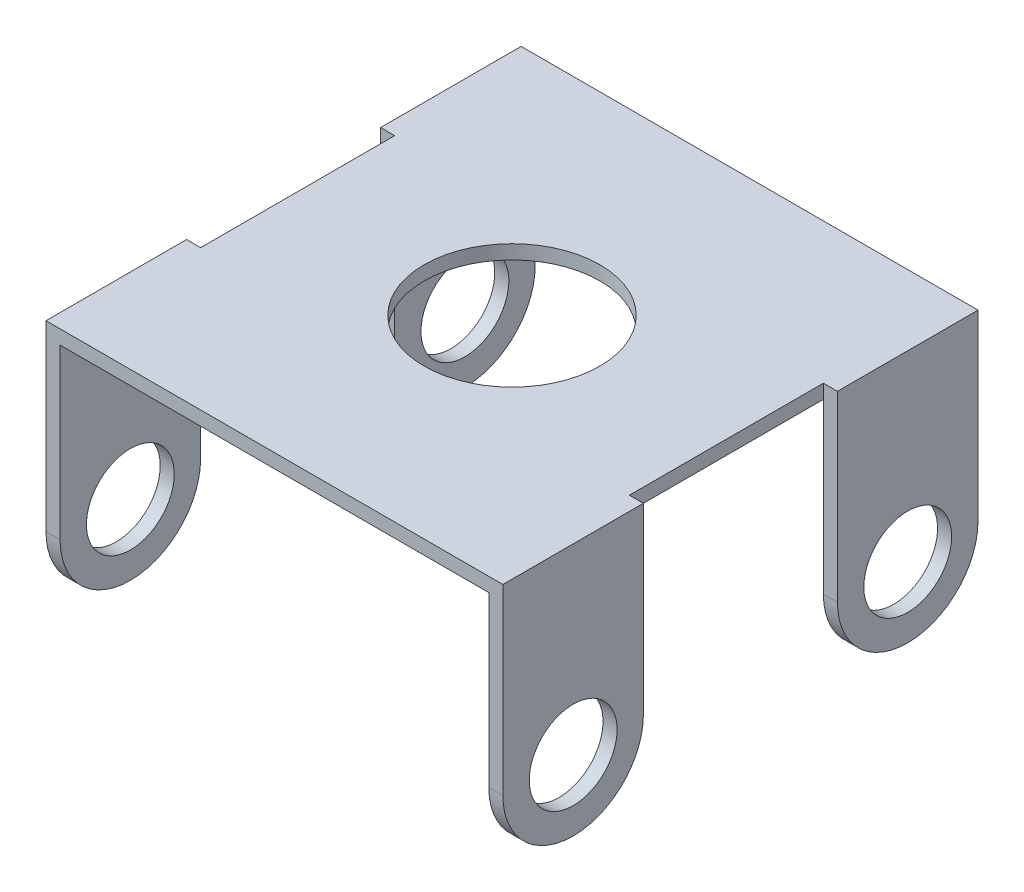
ISO-10303-21;
HEADER;
FILE_DESCRIPTION(('STEP AP214'),'2;1');
FILE_NAME('part.step','',(''),(''),'','','');
FILE_SCHEMA(('AUTOMOTIVE_DESIGN { 1 0 10303 214 1 1 1 1 }'));
ENDSEC;
DATA;
#1=APPLICATION_CONTEXT('core data for automotive mechanical design processes');
#2=APPLICATION_PROTOCOL_DEFINITION('international standard','automotive_design',2000,#1);
#3=PRODUCT_CONTEXT('',#1,'mechanical');
#4=PRODUCT('Part','Part','',(#3));
#5=PRODUCT_RELATED_PRODUCT_CATEGORY('part','',(#4));
#6=PRODUCT_DEFINITION_FORMATION('','',#4);
#7=PRODUCT_DEFINITION_CONTEXT('part definition',#1,'design');
#8=PRODUCT_DEFINITION('design','',#6,#7);
#9=PRODUCT_DEFINITION_SHAPE('','',#8);
#10=(LENGTH_UNIT() NAMED_UNIT(*) SI_UNIT(.MILLI.,.METRE.));
#11=(NAMED_UNIT(*) PLANE_ANGLE_UNIT() SI_UNIT($,.RADIAN.));
#12=(NAMED_UNIT(*) SI_UNIT($,.STERADIAN.) SOLID_ANGLE_UNIT());
#13=UNCERTAINTY_MEASURE_WITH_UNIT(LENGTH_MEASURE(1.E-05),#10,'distance_accuracy_value','');
#14=(GEOMETRIC_REPRESENTATION_CONTEXT(3) GLOBAL_UNCERTAINTY_ASSIGNED_CONTEXT((#13)) GLOBAL_UNIT_ASSIGNED_CONTEXT((#10,
#11,#12)) REPRESENTATION_CONTEXT('',''));
#15=CARTESIAN_POINT('',(0.,0.,0.));
#16=DIRECTION('',(0.,0.,1.));
#17=DIRECTION('',(1.,0.,0.));
#18=AXIS2_PLACEMENT_3D('',#15,#16,#17);
#19=CARTESIAN_POINT('',(-19.3675,1.27,-21.463));
#20=DIRECTION('',(1.,0.,0.));
#21=DIRECTION('',(0.,0.,-1.));
#22=AXIS2_PLACEMENT_3D('',#19,#20,#21);
#23=PLANE('',#22);
#24=DIRECTION('',(0.,0.,1.));
#25=VECTOR('',#24,1.);
#26=CARTESIAN_POINT('',(-19.3675,1.27,-21.463));
#27=LINE('',#26,#25);
#28=CARTESIAN_POINT('',(-19.3675,1.27,-8.76299999999999));
#29=VERTEX_POINT('',#28);
#30=CARTESIAN_POINT('',(-19.3675,1.27,8.76299999999999));
#31=VERTEX_POINT('',#30);
#32=EDGE_CURVE('E51',#29,#31,#27,.T.);
#33=ORIENTED_EDGE('',*,*,#32,.F.);
#34=DIRECTION('',(0.,-1.,0.));
#35=VECTOR('',#34,1.);
#36=CARTESIAN_POINT('',(-19.3675,0.,-8.76299999999999));
#37=LINE('',#36,#35);
#38=CARTESIAN_POINT('',(-19.3675,0.,-8.76299999999999));
#39=VERTEX_POINT('',#38);
#40=EDGE_CURVE('E529',#29,#39,#37,.T.);
#41=ORIENTED_EDGE('',*,*,#40,.T.);
#42=DIRECTION('',(0.,0.,1.));
#43=VECTOR('',#42,1.);
#44=CARTESIAN_POINT('',(-19.3675,0.,-21.463));
#45=LINE('',#44,#43);
#46=CARTESIAN_POINT('',(-19.3675,0.,8.76299999999999));
#47=VERTEX_POINT('',#46);
#48=EDGE_CURVE('E363',#39,#47,#45,.T.);
#49=ORIENTED_EDGE('',*,*,#48,.T.);
#50=DIRECTION('',(0.,-1.,0.));
#51=VECTOR('',#50,1.);
#52=CARTESIAN_POINT('',(-19.3675,0.,8.76299999999999));
#53=LINE('',#52,#51);
#54=EDGE_CURVE('E229',#31,#47,#53,.T.);
#55=ORIENTED_EDGE('',*,*,#54,.F.);
#56=EDGE_LOOP('',(#33,#41,#49,#55));
#57=FACE_BOUND('',#56,.T.);
#58=ADVANCED_FACE('F41',(#57),#23,.F.);
#59=CARTESIAN_POINT('',(19.3675,1.27,-21.463));
#60=DIRECTION('',(-1.,0.,0.));
#61=DIRECTION('',(0.,0.,1.));
#62=AXIS2_PLACEMENT_3D('',#59,#60,#61);
#63=PLANE('',#62);
#64=DIRECTION('',(0.,-1.,0.));
#65=VECTOR('',#64,1.);
#66=CARTESIAN_POINT('',(19.3675,0.,-8.76299999999999));
#67=LINE('',#66,#65);
#68=CARTESIAN_POINT('',(19.3675,1.27,-8.76299999999999));
#69=VERTEX_POINT('',#68);
#70=CARTESIAN_POINT('',(19.3675,0.,-8.76299999999999));
#71=VERTEX_POINT('',#70);
#72=EDGE_CURVE('E276',#69,#71,#67,.T.);
#73=ORIENTED_EDGE('',*,*,#72,.F.);
#74=DIRECTION('',(0.,0.,-1.));
#75=VECTOR('',#74,1.);
#76=CARTESIAN_POINT('',(19.3675,1.27,-21.463));
#77=LINE('',#76,#75);
#78=CARTESIAN_POINT('',(19.3675,1.27,8.76299999999999));
#79=VERTEX_POINT('',#78);
#80=EDGE_CURVE('E341',#79,#69,#77,.T.);
#81=ORIENTED_EDGE('',*,*,#80,.F.);
#82=DIRECTION('',(0.,-1.,0.));
#83=VECTOR('',#82,1.);
#84=CARTESIAN_POINT('',(19.3675,0.,8.76299999999999));
#85=LINE('',#84,#83);
#86=CARTESIAN_POINT('',(19.3675,0.,8.76299999999999));
#87=VERTEX_POINT('',#86);
#88=EDGE_CURVE('E300',#79,#87,#85,.T.);
#89=ORIENTED_EDGE('',*,*,#88,.T.);
#90=DIRECTION('',(0.,0.,-1.));
#91=VECTOR('',#90,1.);
#92=CARTESIAN_POINT('',(19.3675,0.,-21.463));
#93=LINE('',#92,#91);
#94=EDGE_CURVE('E356',#87,#71,#93,.T.);
#95=ORIENTED_EDGE('',*,*,#94,.T.);
#96=EDGE_LOOP('',(#73,#81,#89,#95));
#97=FACE_BOUND('',#96,.T.);
#98=ADVANCED_FACE('F43',(#97),#63,.F.);
#99=CARTESIAN_POINT('',(-19.3675,1.27,-21.463));
#100=DIRECTION('',(0.,0.,1.));
#101=DIRECTION('',(1.,0.,0.));
#102=AXIS2_PLACEMENT_3D('',#99,#100,#101);
#103=PLANE('',#102);
#104=DIRECTION('',(-1.,0.,0.));
#105=VECTOR('',#104,1.);
#106=CARTESIAN_POINT('',(-19.3675,0.,-21.463));
#107=LINE('',#106,#105);
#108=CARTESIAN_POINT('',(19.3675,0.,-21.463));
#109=VERTEX_POINT('',#108);
#110=CARTESIAN_POINT('',(-19.3675,0.,-21.463));
#111=VERTEX_POINT('',#110);
#112=EDGE_CURVE('E355',#109,#111,#107,.T.);
#113=ORIENTED_EDGE('',*,*,#112,.T.);
#114=DIRECTION('',(0.,-1.,0.));
#115=VECTOR('',#114,1.);
#116=CARTESIAN_POINT('',(-19.3675,0.,-21.463));
#117=LINE('',#116,#115);
#118=CARTESIAN_POINT('',(-19.3675,-15.24,-21.463));
#119=VERTEX_POINT('',#118);
#120=EDGE_CURVE('E191',#111,#119,#117,.T.);
#121=ORIENTED_EDGE('',*,*,#120,.T.);
#122=DIRECTION('',(1.,0.,0.));
#123=VECTOR('',#122,1.);
#124=CARTESIAN_POINT('',(-20.6375,-15.24,-21.463));
#125=LINE('',#124,#123);
#126=CARTESIAN_POINT('',(-20.6375,-15.24,-21.463));
#127=VERTEX_POINT('',#126);
#128=EDGE_CURVE('E170',#127,#119,#125,.T.);
#129=ORIENTED_EDGE('',*,*,#128,.F.);
#130=DIRECTION('',(0.,-1.,0.));
#131=VECTOR('',#130,1.);
#132=CARTESIAN_POINT('',(-20.6375,0.,-21.463));
#133=LINE('',#132,#131);
#134=CARTESIAN_POINT('',(-20.6375,1.27,-21.463));
#135=VERTEX_POINT('',#134);
#136=EDGE_CURVE('E178',#135,#127,#133,.T.);
#137=ORIENTED_EDGE('',*,*,#136,.F.);
#138=DIRECTION('',(-1.,0.,0.));
#139=VECTOR('',#138,1.);
#140=CARTESIAN_POINT('',(-19.3675,1.27,-21.463));
#141=LINE('',#140,#139);
#142=CARTESIAN_POINT('',(20.6375,1.27,-21.463));
#143=VERTEX_POINT('',#142);
#144=EDGE_CURVE('E345',#143,#135,#141,.T.);
#145=ORIENTED_EDGE('',*,*,#144,.F.);
#146=DIRECTION('',(0.,-1.,0.));
#147=VECTOR('',#146,1.);
#148=CARTESIAN_POINT('',(20.6375,0.,-21.463));
#149=LINE('',#148,#147);
#150=CARTESIAN_POINT('',(20.6375,-15.24,-21.463));
#151=VERTEX_POINT('',#150);
#152=EDGE_CURVE('E252',#143,#151,#149,.T.);
#153=ORIENTED_EDGE('',*,*,#152,.T.);
#154=DIRECTION('',(-1.,0.,0.));
#155=VECTOR('',#154,1.);
#156=CARTESIAN_POINT('',(20.6375,-15.24,-21.463));
#157=LINE('',#156,#155);
#158=CARTESIAN_POINT('',(19.3675,-15.24,-21.463));
#159=VERTEX_POINT('',#158);
#160=EDGE_CURVE('E268',#151,#159,#157,.T.);
#161=ORIENTED_EDGE('',*,*,#160,.T.);
#162=DIRECTION('',(0.,-1.,0.));
#163=VECTOR('',#162,1.);
#164=CARTESIAN_POINT('',(19.3675,0.,-21.463));
#165=LINE('',#164,#163);
#166=EDGE_CURVE('E272',#109,#159,#165,.T.);
#167=ORIENTED_EDGE('',*,*,#166,.F.);
#168=EDGE_LOOP('',(#113,#121,#129,#137,#145,#153,#161,#167));
#169=FACE_BOUND('',#168,.T.);
#170=ADVANCED_FACE('F189',(#169),#103,.F.);
#171=CARTESIAN_POINT('',(-19.3675,1.27,21.463));
#172=DIRECTION('',(0.,0.,-1.));
#173=DIRECTION('',(-1.,0.,0.));
#174=AXIS2_PLACEMENT_3D('',#171,#172,#173);
#175=PLANE('',#174);
#176=DIRECTION('',(1.,0.,0.));
#177=VECTOR('',#176,1.);
#178=CARTESIAN_POINT('',(-19.3675,0.,21.463));
#179=LINE('',#178,#177);
#180=CARTESIAN_POINT('',(-19.3675,0.,21.463));
#181=VERTEX_POINT('',#180);
#182=CARTESIAN_POINT('',(19.3675,0.,21.463));
#183=VERTEX_POINT('',#182);
#184=EDGE_CURVE('E346',#181,#183,#179,.T.);
#185=ORIENTED_EDGE('',*,*,#184,.T.);
#186=DIRECTION('',(0.,-1.,0.));
#187=VECTOR('',#186,1.);
#188=CARTESIAN_POINT('',(19.3675,0.,21.463));
#189=LINE('',#188,#187);
#190=CARTESIAN_POINT('',(19.3675,-15.24,21.463));
#191=VERTEX_POINT('',#190);
#192=EDGE_CURVE('E319',#183,#191,#189,.T.);
#193=ORIENTED_EDGE('',*,*,#192,.T.);
#194=DIRECTION('',(-1.,0.,0.));
#195=VECTOR('',#194,1.);
#196=CARTESIAN_POINT('',(20.6375,-15.24,21.463));
#197=LINE('',#196,#195);
#198=CARTESIAN_POINT('',(20.6375,-15.24,21.463));
#199=VERTEX_POINT('',#198);
#200=EDGE_CURVE('E336',#199,#191,#197,.T.);
#201=ORIENTED_EDGE('',*,*,#200,.F.);
#202=DIRECTION('',(0.,-1.,0.));
#203=VECTOR('',#202,1.);
#204=CARTESIAN_POINT('',(20.6375,0.,21.463));
#205=LINE('',#204,#203);
#206=CARTESIAN_POINT('',(20.6375,1.27,21.463));
#207=VERTEX_POINT('',#206);
#208=EDGE_CURVE('E299',#207,#199,#205,.T.);
#209=ORIENTED_EDGE('',*,*,#208,.F.);
#210=DIRECTION('',(1.,0.,0.));
#211=VECTOR('',#210,1.);
#212=CARTESIAN_POINT('',(-19.3675,1.27,21.463));
#213=LINE('',#212,#211);
#214=CARTESIAN_POINT('',(-20.6375,1.27,21.463));
#215=VERTEX_POINT('',#214);
#216=EDGE_CURVE('E11',#215,#207,#213,.T.);
#217=ORIENTED_EDGE('',*,*,#216,.F.);
#218=DIRECTION('',(0.,-1.,0.));
#219=VECTOR('',#218,1.);
#220=CARTESIAN_POINT('',(-20.6375,0.,21.463));
#221=LINE('',#220,#219);
#222=CARTESIAN_POINT('',(-20.6375,-15.24,21.463));
#223=VERTEX_POINT('',#222);
#224=EDGE_CURVE('E209',#215,#223,#221,.T.);
#225=ORIENTED_EDGE('',*,*,#224,.T.);
#226=DIRECTION('',(1.,0.,0.));
#227=VECTOR('',#226,1.);
#228=CARTESIAN_POINT('',(-20.6375,-15.24,21.463));
#229=LINE('',#228,#227);
#230=CARTESIAN_POINT('',(-19.3675,-15.24,21.463));
#231=VERTEX_POINT('',#230);
#232=EDGE_CURVE('E224',#223,#231,#229,.T.);
#233=ORIENTED_EDGE('',*,*,#232,.T.);
#234=DIRECTION('',(0.,-1.,0.));
#235=VECTOR('',#234,1.);
#236=CARTESIAN_POINT('',(-19.3675,0.,21.463));
#237=LINE('',#236,#235);
#238=EDGE_CURVE('E199',#181,#231,#237,.T.);
#239=ORIENTED_EDGE('',*,*,#238,.F.);
#240=EDGE_LOOP('',(#185,#193,#201,#209,#217,#225,#233,#239));
#241=FACE_BOUND('',#240,.T.);
#242=ADVANCED_FACE('F369',(#241),#175,.F.);
#243=CARTESIAN_POINT('',(0.,1.27,0.));
#244=DIRECTION('',(0.,1.,0.));
#245=DIRECTION('',(0.,0.,1.));
#246=AXIS2_PLACEMENT_3D('',#243,#244,#245);
#247=PLANE('',#246);
#248=CARTESIAN_POINT('',(0.,1.27,0.));
#249=DIRECTION('',(0.,1.,0.));
#250=DIRECTION('',(0.,0.,1.));
#251=AXIS2_PLACEMENT_3D('',#248,#249,#250);
#252=CIRCLE('',#251,7.9375);
#253=CARTESIAN_POINT('',(0.,1.27,7.9375));
#254=VERTEX_POINT('',#253);
#255=EDGE_CURVE('E516',#254,#254,#252,.T.);
#256=ORIENTED_EDGE('',*,*,#255,.F.);
#257=EDGE_LOOP('',(#256));
#258=FACE_BOUND('',#257,.T.);
#259=ORIENTED_EDGE('',*,*,#216,.T.);
#260=DIRECTION('',(0.,0.,1.));
#261=VECTOR('',#260,1.);
#262=CARTESIAN_POINT('',(20.6375,1.27,0.));
#263=LINE('',#262,#261);
#264=CARTESIAN_POINT('',(20.6375,1.27,8.76299999999999));
#265=VERTEX_POINT('',#264);
#266=EDGE_CURVE('E311',#265,#207,#263,.T.);
#267=ORIENTED_EDGE('',*,*,#266,.F.);
#268=DIRECTION('',(-1.,0.,0.));
#269=VECTOR('',#268,1.);
#270=CARTESIAN_POINT('',(20.6375,1.27,8.76299999999999));
#271=LINE('',#270,#269);
#272=EDGE_CURVE('E315',#265,#79,#271,.T.);
#273=ORIENTED_EDGE('',*,*,#272,.T.);
#274=ORIENTED_EDGE('',*,*,#80,.T.);
#275=DIRECTION('',(-1.,0.,0.));
#276=VECTOR('',#275,1.);
#277=CARTESIAN_POINT('',(20.6375,1.27,-8.76299999999999));
#278=LINE('',#277,#276);
#279=CARTESIAN_POINT('',(20.6375,1.27,-8.76299999999999));
#280=VERTEX_POINT('',#279);
#281=EDGE_CURVE('E290',#280,#69,#278,.T.);
#282=ORIENTED_EDGE('',*,*,#281,.F.);
#283=DIRECTION('',(0.,0.,-1.));
#284=VECTOR('',#283,1.);
#285=CARTESIAN_POINT('',(20.6375,1.27,0.));
#286=LINE('',#285,#284);
#287=EDGE_CURVE('E257',#280,#143,#286,.T.);
#288=ORIENTED_EDGE('',*,*,#287,.T.);
#289=ORIENTED_EDGE('',*,*,#144,.T.);
#290=DIRECTION('',(0.,0.,-1.));
#291=VECTOR('',#290,1.);
#292=CARTESIAN_POINT('',(-20.6375,1.27,0.));
#293=LINE('',#292,#291);
#294=CARTESIAN_POINT('',(-20.6375,1.27,-8.76299999999999));
#295=VERTEX_POINT('',#294);
#296=EDGE_CURVE('E184',#295,#135,#293,.T.);
#297=ORIENTED_EDGE('',*,*,#296,.F.);
#298=DIRECTION('',(1.,0.,0.));
#299=VECTOR('',#298,1.);
#300=CARTESIAN_POINT('',(-20.6375,1.27,-8.76299999999999));
#301=LINE('',#300,#299);
#302=EDGE_CURVE('E201',#295,#29,#301,.T.);
#303=ORIENTED_EDGE('',*,*,#302,.T.);
#304=ORIENTED_EDGE('',*,*,#32,.T.);
#305=DIRECTION('',(1.,0.,0.));
#306=VECTOR('',#305,1.);
#307=CARTESIAN_POINT('',(-20.6375,1.27,8.76299999999999));
#308=LINE('',#307,#306);
#309=CARTESIAN_POINT('',(-20.6375,1.27,8.76299999999999));
#310=VERTEX_POINT('',#309);
#311=EDGE_CURVE('E243',#310,#31,#308,.T.);
#312=ORIENTED_EDGE('',*,*,#311,.F.);
#313=DIRECTION('',(0.,0.,1.));
#314=VECTOR('',#313,1.);
#315=CARTESIAN_POINT('',(-20.6375,1.27,0.));
#316=LINE('',#315,#314);
#317=EDGE_CURVE('E214',#310,#215,#316,.T.);
#318=ORIENTED_EDGE('',*,*,#317,.T.);
#319=EDGE_LOOP('',(#259,#267,#273,#274,#282,#288,#289,#297,#303,#304,#312,#318));
#320=FACE_BOUND('',#319,.T.);
#321=ADVANCED_FACE('F407',(#258,#320),#247,.T.);
#322=CARTESIAN_POINT('',(0.,0.,0.));
#323=DIRECTION('',(0.,1.,0.));
#324=DIRECTION('',(0.,0.,1.));
#325=AXIS2_PLACEMENT_3D('',#322,#323,#324);
#326=PLANE('',#325);
#327=CARTESIAN_POINT('',(0.,0.,0.));
#328=DIRECTION('',(0.,1.,0.));
#329=DIRECTION('',(0.,0.,1.));
#330=AXIS2_PLACEMENT_3D('',#327,#328,#329);
#331=CIRCLE('',#330,7.9375);
#332=CARTESIAN_POINT('',(0.,0.,7.9375));
#333=VERTEX_POINT('',#332);
#334=EDGE_CURVE('E45',#333,#333,#331,.T.);
#335=ORIENTED_EDGE('',*,*,#334,.T.);
#336=EDGE_LOOP('',(#335));
#337=FACE_BOUND('',#336,.T.);
#338=EDGE_CURVE('E351',#183,#87,#93,.T.);
#339=ORIENTED_EDGE('',*,*,#338,.F.);
#340=ORIENTED_EDGE('',*,*,#184,.F.);
#341=EDGE_CURVE('E359',#47,#181,#45,.T.);
#342=ORIENTED_EDGE('',*,*,#341,.F.);
#343=ORIENTED_EDGE('',*,*,#48,.F.);
#344=EDGE_CURVE('E360',#111,#39,#45,.T.);
#345=ORIENTED_EDGE('',*,*,#344,.F.);
#346=ORIENTED_EDGE('',*,*,#112,.F.);
#347=EDGE_CURVE('E340',#71,#109,#93,.T.);
#348=ORIENTED_EDGE('',*,*,#347,.F.);
#349=ORIENTED_EDGE('',*,*,#94,.F.);
#350=EDGE_LOOP('',(#339,#340,#342,#343,#345,#346,#348,#349));
#351=FACE_BOUND('',#350,.T.);
#352=ADVANCED_FACE('F376',(#337,#351),#326,.F.);
#353=CARTESIAN_POINT('',(19.3675,0.,0.));
#354=DIRECTION('',(1.,0.,0.));
#355=DIRECTION('',(0.,0.,-1.));
#356=AXIS2_PLACEMENT_3D('',#353,#354,#355);
#357=PLANE('',#356);
#358=CARTESIAN_POINT('',(19.3675,-15.24,15.113));
#359=DIRECTION('',(1.,0.,0.));
#360=DIRECTION('',(0.,0.,-1.));
#361=AXIS2_PLACEMENT_3D('',#358,#359,#360);
#362=CIRCLE('',#361,3.96875);
#363=CARTESIAN_POINT('',(19.3675,-15.24,11.14425));
#364=VERTEX_POINT('',#363);
#365=EDGE_CURVE('E294',#364,#364,#362,.T.);
#366=ORIENTED_EDGE('',*,*,#365,.T.);
#367=EDGE_LOOP('',(#366));
#368=FACE_BOUND('',#367,.T.);
#369=ORIENTED_EDGE('',*,*,#192,.F.);
#370=ORIENTED_EDGE('',*,*,#338,.T.);
#371=CARTESIAN_POINT('',(19.3675,-15.24,8.76299999999999));
#372=VERTEX_POINT('',#371);
#373=EDGE_CURVE('E326',#87,#372,#85,.T.);
#374=ORIENTED_EDGE('',*,*,#373,.T.);
#375=CARTESIAN_POINT('',(19.3675,-15.24,15.113));
#376=DIRECTION('',(1.,0.,0.));
#377=DIRECTION('',(0.,0.,-1.));
#378=AXIS2_PLACEMENT_3D('',#375,#376,#377);
#379=CIRCLE('',#378,6.35000000000001);
#380=EDGE_CURVE('E322',#191,#372,#379,.T.);
#381=ORIENTED_EDGE('',*,*,#380,.F.);
#382=EDGE_LOOP('',(#369,#370,#374,#381));
#383=FACE_BOUND('',#382,.T.);
#384=ADVANCED_FACE('F379',(#368,#383),#357,.F.);
#385=CARTESIAN_POINT('',(20.6375,-15.24,15.113));
#386=DIRECTION('',(-1.,0.,0.));
#387=DIRECTION('',(0.,0.,1.));
#388=AXIS2_PLACEMENT_3D('',#385,#386,#387);
#389=CYLINDRICAL_SURFACE('',#388,6.35000000000001);
#390=ORIENTED_EDGE('',*,*,#380,.T.);
#391=DIRECTION('',(-1.,0.,0.));
#392=VECTOR('',#391,1.);
#393=CARTESIAN_POINT('',(20.6375,-15.24,8.76299999999999));
#394=LINE('',#393,#392);
#395=CARTESIAN_POINT('',(20.6375,-15.24,8.76299999999999));
#396=VERTEX_POINT('',#395);
#397=EDGE_CURVE('E332',#396,#372,#394,.T.);
#398=ORIENTED_EDGE('',*,*,#397,.F.);
#399=CARTESIAN_POINT('',(20.6375,-15.24,15.113));
#400=DIRECTION('',(1.,0.,0.));
#401=DIRECTION('',(0.,0.,-1.));
#402=AXIS2_PLACEMENT_3D('',#399,#400,#401);
#403=CIRCLE('',#402,6.35000000000001);
#404=EDGE_CURVE('E304',#199,#396,#403,.T.);
#405=ORIENTED_EDGE('',*,*,#404,.F.);
#406=ORIENTED_EDGE('',*,*,#200,.T.);
#407=EDGE_LOOP('',(#390,#398,#405,#406));
#408=FACE_BOUND('',#407,.T.);
#409=ADVANCED_FACE('F412',(#408),#389,.T.);
#410=CARTESIAN_POINT('',(20.6375,0.,8.76299999999999));
#411=DIRECTION('',(0.,0.,-1.));
#412=DIRECTION('',(0.,1.,0.));
#413=AXIS2_PLACEMENT_3D('',#410,#411,#412);
#414=PLANE('',#413);
#415=ORIENTED_EDGE('',*,*,#88,.F.);
#416=ORIENTED_EDGE('',*,*,#272,.F.);
#417=DIRECTION('',(0.,-1.,0.));
#418=VECTOR('',#417,1.);
#419=CARTESIAN_POINT('',(20.6375,0.,8.76299999999999));
#420=LINE('',#419,#418);
#421=EDGE_CURVE('E307',#265,#396,#420,.T.);
#422=ORIENTED_EDGE('',*,*,#421,.T.);
#423=ORIENTED_EDGE('',*,*,#397,.T.);
#424=ORIENTED_EDGE('',*,*,#373,.F.);
#425=EDGE_LOOP('',(#415,#416,#422,#423,#424));
#426=FACE_BOUND('',#425,.T.);
#427=ADVANCED_FACE('F385',(#426),#414,.T.);
#428=CARTESIAN_POINT('',(20.6375,-15.24,15.113));
#429=DIRECTION('',(-1.,0.,0.));
#430=DIRECTION('',(0.,0.,1.));
#431=AXIS2_PLACEMENT_3D('',#428,#429,#430);
#432=CYLINDRICAL_SURFACE('',#431,3.96875);
#433=CARTESIAN_POINT('',(20.6375,-15.24,15.113));
#434=DIRECTION('',(1.,0.,0.));
#435=DIRECTION('',(0.,0.,-1.));
#436=AXIS2_PLACEMENT_3D('',#433,#434,#435);
#437=CIRCLE('',#436,3.96875);
#438=CARTESIAN_POINT('',(20.6375,-15.24,11.14425));
#439=VERTEX_POINT('',#438);
#440=EDGE_CURVE('E295',#439,#439,#437,.T.);
#441=ORIENTED_EDGE('',*,*,#440,.T.);
#442=EDGE_LOOP('',(#441));
#443=FACE_BOUND('',#442,.T.);
#444=ORIENTED_EDGE('',*,*,#365,.F.);
#445=EDGE_LOOP('',(#444));
#446=FACE_BOUND('',#445,.T.);
#447=ADVANCED_FACE('F419',(#443,#446),#432,.F.);
#448=CARTESIAN_POINT('',(20.6375,0.,0.));
#449=DIRECTION('',(1.,0.,0.));
#450=DIRECTION('',(0.,0.,-1.));
#451=AXIS2_PLACEMENT_3D('',#448,#449,#450);
#452=PLANE('',#451);
#453=ORIENTED_EDGE('',*,*,#440,.F.);
#454=EDGE_LOOP('',(#453));
#455=FACE_BOUND('',#454,.T.);
#456=ORIENTED_EDGE('',*,*,#208,.T.);
#457=ORIENTED_EDGE('',*,*,#404,.T.);
#458=ORIENTED_EDGE('',*,*,#421,.F.);
#459=ORIENTED_EDGE('',*,*,#266,.T.);
#460=EDGE_LOOP('',(#456,#457,#458,#459));
#461=FACE_BOUND('',#460,.T.);
#462=ADVANCED_FACE('F410',(#455,#461),#452,.T.);
#463=CARTESIAN_POINT('',(19.3675,0.,0.));
#464=DIRECTION('',(1.,0.,0.));
#465=DIRECTION('',(0.,0.,1.));
#466=AXIS2_PLACEMENT_3D('',#463,#464,#465);
#467=PLANE('',#466);
#468=CARTESIAN_POINT('',(19.3675,-15.24,-15.113));
#469=DIRECTION('',(-1.,0.,0.));
#470=DIRECTION('',(0.,0.,1.));
#471=AXIS2_PLACEMENT_3D('',#468,#469,#470);
#472=CIRCLE('',#471,3.96875);
#473=CARTESIAN_POINT('',(19.3675,-15.24,-11.14425));
#474=VERTEX_POINT('',#473);
#475=EDGE_CURVE('E247',#474,#474,#472,.T.);
#476=ORIENTED_EDGE('',*,*,#475,.F.);
#477=EDGE_LOOP('',(#476));
#478=FACE_BOUND('',#477,.T.);
#479=CARTESIAN_POINT('',(19.3675,-15.24,-8.76299999999999));
#480=VERTEX_POINT('',#479);
#481=EDGE_CURVE('E275',#71,#480,#67,.T.);
#482=ORIENTED_EDGE('',*,*,#481,.F.);
#483=ORIENTED_EDGE('',*,*,#347,.T.);
#484=ORIENTED_EDGE('',*,*,#166,.T.);
#485=CARTESIAN_POINT('',(19.3675,-15.24,-15.113));
#486=DIRECTION('',(-1.,0.,0.));
#487=DIRECTION('',(0.,0.,1.));
#488=AXIS2_PLACEMENT_3D('',#485,#486,#487);
#489=CIRCLE('',#488,6.35000000000001);
#490=EDGE_CURVE('E253',#159,#480,#489,.T.);
#491=ORIENTED_EDGE('',*,*,#490,.T.);
#492=EDGE_LOOP('',(#482,#483,#484,#491));
#493=FACE_BOUND('',#492,.T.);
#494=ADVANCED_FACE('F450',(#478,#493),#467,.F.);
#495=CARTESIAN_POINT('',(20.6375,0.,-8.76299999999999));
#496=DIRECTION('',(0.,0.,-1.));
#497=DIRECTION('',(0.,1.,0.));
#498=AXIS2_PLACEMENT_3D('',#495,#496,#497);
#499=PLANE('',#498);
#500=ORIENTED_EDGE('',*,*,#72,.T.);
#501=ORIENTED_EDGE('',*,*,#481,.T.);
#502=DIRECTION('',(-1.,0.,0.));
#503=VECTOR('',#502,1.);
#504=CARTESIAN_POINT('',(20.6375,-15.24,-8.76299999999999));
#505=LINE('',#504,#503);
#506=CARTESIAN_POINT('',(20.6375,-15.24,-8.76299999999999));
#507=VERTEX_POINT('',#506);
#508=EDGE_CURVE('E286',#507,#480,#505,.T.);
#509=ORIENTED_EDGE('',*,*,#508,.F.);
#510=DIRECTION('',(0.,-1.,0.));
#511=VECTOR('',#510,1.);
#512=CARTESIAN_POINT('',(20.6375,0.,-8.76299999999999));
#513=LINE('',#512,#511);
#514=EDGE_CURVE('E261',#280,#507,#513,.T.);
#515=ORIENTED_EDGE('',*,*,#514,.F.);
#516=ORIENTED_EDGE('',*,*,#281,.T.);
#517=EDGE_LOOP('',(#500,#501,#509,#515,#516));
#518=FACE_BOUND('',#517,.T.);
#519=ADVANCED_FACE('F459',(#518),#499,.F.);
#520=CARTESIAN_POINT('',(20.6375,-15.24,-15.113));
#521=DIRECTION('',(-1.,0.,0.));
#522=DIRECTION('',(0.,0.,1.));
#523=AXIS2_PLACEMENT_3D('',#520,#521,#522);
#524=CYLINDRICAL_SURFACE('',#523,3.96875);
#525=CARTESIAN_POINT('',(20.6375,-15.24,-15.113));
#526=DIRECTION('',(-1.,0.,0.));
#527=DIRECTION('',(0.,0.,1.));
#528=AXIS2_PLACEMENT_3D('',#525,#526,#527);
#529=CIRCLE('',#528,3.96875);
#530=CARTESIAN_POINT('',(20.6375,-15.24,-11.14425));
#531=VERTEX_POINT('',#530);
#532=EDGE_CURVE('E248',#531,#531,#529,.T.);
#533=ORIENTED_EDGE('',*,*,#532,.F.);
#534=EDGE_LOOP('',(#533));
#535=FACE_BOUND('',#534,.T.);
#536=ORIENTED_EDGE('',*,*,#475,.T.);
#537=EDGE_LOOP('',(#536));
#538=FACE_BOUND('',#537,.T.);
#539=ADVANCED_FACE('F463',(#535,#538),#524,.F.);
#540=CARTESIAN_POINT('',(20.6375,-15.24,-15.113));
#541=DIRECTION('',(-1.,0.,0.));
#542=DIRECTION('',(0.,0.,1.));
#543=AXIS2_PLACEMENT_3D('',#540,#541,#542);
#544=CYLINDRICAL_SURFACE('',#543,6.35000000000001);
#545=ORIENTED_EDGE('',*,*,#490,.F.);
#546=ORIENTED_EDGE('',*,*,#160,.F.);
#547=CARTESIAN_POINT('',(20.6375,-15.24,-15.113));
#548=DIRECTION('',(-1.,0.,0.));
#549=DIRECTION('',(0.,0.,1.));
#550=AXIS2_PLACEMENT_3D('',#547,#548,#549);
#551=CIRCLE('',#550,6.35000000000001);
#552=EDGE_CURVE('E264',#151,#507,#551,.T.);
#553=ORIENTED_EDGE('',*,*,#552,.T.);
#554=ORIENTED_EDGE('',*,*,#508,.T.);
#555=EDGE_LOOP('',(#545,#546,#553,#554));
#556=FACE_BOUND('',#555,.T.);
#557=ADVANCED_FACE('F466',(#556),#544,.T.);
#558=CARTESIAN_POINT('',(20.6375,0.,0.));
#559=DIRECTION('',(1.,0.,0.));
#560=DIRECTION('',(0.,0.,1.));
#561=AXIS2_PLACEMENT_3D('',#558,#559,#560);
#562=PLANE('',#561);
#563=ORIENTED_EDGE('',*,*,#532,.T.);
#564=EDGE_LOOP('',(#563));
#565=FACE_BOUND('',#564,.T.);
#566=ORIENTED_EDGE('',*,*,#152,.F.);
#567=ORIENTED_EDGE('',*,*,#287,.F.);
#568=ORIENTED_EDGE('',*,*,#514,.T.);
#569=ORIENTED_EDGE('',*,*,#552,.F.);
#570=EDGE_LOOP('',(#566,#567,#568,#569));
#571=FACE_BOUND('',#570,.T.);
#572=ADVANCED_FACE('F472',(#565,#571),#562,.T.);
#573=CARTESIAN_POINT('',(-19.3675,0.,0.));
#574=DIRECTION('',(-1.,0.,0.));
#575=DIRECTION('',(0.,0.,-1.));
#576=AXIS2_PLACEMENT_3D('',#573,#574,#575);
#577=PLANE('',#576);
#578=CARTESIAN_POINT('',(-19.3675,-15.24,15.113));
#579=DIRECTION('',(1.,0.,0.));
#580=DIRECTION('',(0.,0.,-1.));
#581=AXIS2_PLACEMENT_3D('',#578,#579,#580);
#582=CIRCLE('',#581,3.96875);
#583=CARTESIAN_POINT('',(-19.3675,-15.24,11.14425));
#584=VERTEX_POINT('',#583);
#585=EDGE_CURVE('E194',#584,#584,#582,.T.);
#586=ORIENTED_EDGE('',*,*,#585,.F.);
#587=EDGE_LOOP('',(#586));
#588=FACE_BOUND('',#587,.T.);
#589=CARTESIAN_POINT('',(-19.3675,-15.24,8.76299999999999));
#590=VERTEX_POINT('',#589);
#591=EDGE_CURVE('E228',#47,#590,#53,.T.);
#592=ORIENTED_EDGE('',*,*,#591,.F.);
#593=ORIENTED_EDGE('',*,*,#341,.T.);
#594=ORIENTED_EDGE('',*,*,#238,.T.);
#595=CARTESIAN_POINT('',(-19.3675,-15.24,15.113));
#596=DIRECTION('',(1.,0.,0.));
#597=DIRECTION('',(0.,0.,-1.));
#598=AXIS2_PLACEMENT_3D('',#595,#596,#597);
#599=CIRCLE('',#598,6.35000000000001);
#600=EDGE_CURVE('E210',#231,#590,#599,.T.);
#601=ORIENTED_EDGE('',*,*,#600,.T.);
#602=EDGE_LOOP('',(#592,#593,#594,#601));
#603=FACE_BOUND('',#602,.T.);
#604=ADVANCED_FACE('F401',(#588,#603),#577,.F.);
#605=CARTESIAN_POINT('',(-20.6375,0.,8.76299999999999));
#606=DIRECTION('',(0.,0.,1.));
#607=DIRECTION('',(0.,-1.,0.));
#608=AXIS2_PLACEMENT_3D('',#605,#606,#607);
#609=PLANE('',#608);
#610=ORIENTED_EDGE('',*,*,#54,.T.);
#611=ORIENTED_EDGE('',*,*,#591,.T.);
#612=DIRECTION('',(1.,0.,0.));
#613=VECTOR('',#612,1.);
#614=CARTESIAN_POINT('',(-20.6375,-15.24,8.76299999999999));
#615=LINE('',#614,#613);
#616=CARTESIAN_POINT('',(-20.6375,-15.24,8.76299999999999));
#617=VERTEX_POINT('',#616);
#618=EDGE_CURVE('E239',#617,#590,#615,.T.);
#619=ORIENTED_EDGE('',*,*,#618,.F.);
#620=DIRECTION('',(0.,-1.,0.));
#621=VECTOR('',#620,1.);
#622=CARTESIAN_POINT('',(-20.6375,0.,8.76299999999999));
#623=LINE('',#622,#621);
#624=EDGE_CURVE('E218',#310,#617,#623,.T.);
#625=ORIENTED_EDGE('',*,*,#624,.F.);
#626=ORIENTED_EDGE('',*,*,#311,.T.);
#627=EDGE_LOOP('',(#610,#611,#619,#625,#626));
#628=FACE_BOUND('',#627,.T.);
#629=ADVANCED_FACE('F394',(#628),#609,.F.);
#630=CARTESIAN_POINT('',(-20.6375,-15.24,15.113));
#631=DIRECTION('',(1.,0.,0.));
#632=DIRECTION('',(0.,0.,-1.));
#633=AXIS2_PLACEMENT_3D('',#630,#631,#632);
#634=CYLINDRICAL_SURFACE('',#633,3.96875);
#635=CARTESIAN_POINT('',(-20.6375,-15.24,15.113));
#636=DIRECTION('',(1.,0.,0.));
#637=DIRECTION('',(0.,0.,-1.));
#638=AXIS2_PLACEMENT_3D('',#635,#636,#637);
#639=CIRCLE('',#638,3.96875);
#640=CARTESIAN_POINT('',(-20.6375,-15.24,11.14425));
#641=VERTEX_POINT('',#640);
#642=EDGE_CURVE('E205',#641,#641,#639,.T.);
#643=ORIENTED_EDGE('',*,*,#642,.F.);
#644=EDGE_LOOP('',(#643));
#645=FACE_BOUND('',#644,.T.);
#646=ORIENTED_EDGE('',*,*,#585,.T.);
#647=EDGE_LOOP('',(#646));
#648=FACE_BOUND('',#647,.T.);
#649=ADVANCED_FACE('F478',(#645,#648),#634,.F.);
#650=CARTESIAN_POINT('',(-20.6375,-15.24,15.113));
#651=DIRECTION('',(1.,0.,0.));
#652=DIRECTION('',(0.,0.,-1.));
#653=AXIS2_PLACEMENT_3D('',#650,#651,#652);
#654=CYLINDRICAL_SURFACE('',#653,6.35000000000001);
#655=ORIENTED_EDGE('',*,*,#600,.F.);
#656=ORIENTED_EDGE('',*,*,#232,.F.);
#657=CARTESIAN_POINT('',(-20.6375,-15.24,15.113));
#658=DIRECTION('',(1.,0.,0.));
#659=DIRECTION('',(0.,0.,-1.));
#660=AXIS2_PLACEMENT_3D('',#657,#658,#659);
#661=CIRCLE('',#660,6.35000000000001);
#662=EDGE_CURVE('E221',#223,#617,#661,.T.);
#663=ORIENTED_EDGE('',*,*,#662,.T.);
#664=ORIENTED_EDGE('',*,*,#618,.T.);
#665=EDGE_LOOP('',(#655,#656,#663,#664));
#666=FACE_BOUND('',#665,.T.);
#667=ADVANCED_FACE('F399',(#666),#654,.T.);
#668=CARTESIAN_POINT('',(-20.6375,0.,0.));
#669=DIRECTION('',(-1.,0.,0.));
#670=DIRECTION('',(0.,0.,-1.));
#671=AXIS2_PLACEMENT_3D('',#668,#669,#670);
#672=PLANE('',#671);
#673=ORIENTED_EDGE('',*,*,#642,.T.);
#674=EDGE_LOOP('',(#673));
#675=FACE_BOUND('',#674,.T.);
#676=ORIENTED_EDGE('',*,*,#224,.F.);
#677=ORIENTED_EDGE('',*,*,#317,.F.);
#678=ORIENTED_EDGE('',*,*,#624,.T.);
#679=ORIENTED_EDGE('',*,*,#662,.F.);
#680=EDGE_LOOP('',(#676,#677,#678,#679));
#681=FACE_BOUND('',#680,.T.);
#682=ADVANCED_FACE('F406',(#675,#681),#672,.T.);
#683=CARTESIAN_POINT('',(-19.3675,0.,0.));
#684=DIRECTION('',(-1.,0.,0.));
#685=DIRECTION('',(0.,0.,1.));
#686=AXIS2_PLACEMENT_3D('',#683,#684,#685);
#687=PLANE('',#686);
#688=CARTESIAN_POINT('',(-19.3675,-15.24,-15.113));
#689=DIRECTION('',(-1.,0.,0.));
#690=DIRECTION('',(0.,0.,1.));
#691=AXIS2_PLACEMENT_3D('',#688,#689,#690);
#692=CIRCLE('',#691,3.96875);
#693=CARTESIAN_POINT('',(-19.3675,-15.24,-11.14425));
#694=VERTEX_POINT('',#693);
#695=EDGE_CURVE('E520',#694,#694,#692,.T.);
#696=ORIENTED_EDGE('',*,*,#695,.T.);
#697=EDGE_LOOP('',(#696));
#698=FACE_BOUND('',#697,.T.);
#699=ORIENTED_EDGE('',*,*,#120,.F.);
#700=ORIENTED_EDGE('',*,*,#344,.T.);
#701=CARTESIAN_POINT('',(-19.3675,-15.24,-8.76299999999999));
#702=VERTEX_POINT('',#701);
#703=EDGE_CURVE('E540',#39,#702,#37,.T.);
#704=ORIENTED_EDGE('',*,*,#703,.T.);
#705=CARTESIAN_POINT('',(-19.3675,-15.24,-15.113));
#706=DIRECTION('',(-1.,0.,0.));
#707=DIRECTION('',(0.,0.,1.));
#708=AXIS2_PLACEMENT_3D('',#705,#706,#707);
#709=CIRCLE('',#708,6.35000000000001);
#710=EDGE_CURVE('E537',#119,#702,#709,.T.);
#711=ORIENTED_EDGE('',*,*,#710,.F.);
#712=EDGE_LOOP('',(#699,#700,#704,#711));
#713=FACE_BOUND('',#712,.T.);
#714=ADVANCED_FACE('F491',(#698,#713),#687,.F.);
#715=CARTESIAN_POINT('',(-20.6375,-15.24,-15.113));
#716=DIRECTION('',(1.,0.,0.));
#717=DIRECTION('',(0.,0.,-1.));
#718=AXIS2_PLACEMENT_3D('',#715,#716,#717);
#719=CYLINDRICAL_SURFACE('',#718,6.35000000000001);
#720=ORIENTED_EDGE('',*,*,#710,.T.);
#721=DIRECTION('',(1.,0.,0.));
#722=VECTOR('',#721,1.);
#723=CARTESIAN_POINT('',(-20.6375,-15.24,-8.76299999999999));
#724=LINE('',#723,#722);
#725=CARTESIAN_POINT('',(-20.6375,-15.24,-8.76299999999999));
#726=VERTEX_POINT('',#725);
#727=EDGE_CURVE('E172',#726,#702,#724,.T.);
#728=ORIENTED_EDGE('',*,*,#727,.F.);
#729=CARTESIAN_POINT('',(-20.6375,-15.24,-15.113));
#730=DIRECTION('',(-1.,0.,0.));
#731=DIRECTION('',(0.,0.,1.));
#732=AXIS2_PLACEMENT_3D('',#729,#730,#731);
#733=CIRCLE('',#732,6.35000000000001);
#734=EDGE_CURVE('E165',#127,#726,#733,.T.);
#735=ORIENTED_EDGE('',*,*,#734,.F.);
#736=ORIENTED_EDGE('',*,*,#128,.T.);
#737=EDGE_LOOP('',(#720,#728,#735,#736));
#738=FACE_BOUND('',#737,.T.);
#739=ADVANCED_FACE('F168',(#738),#719,.T.);
#740=CARTESIAN_POINT('',(-20.6375,0.,-8.76299999999999));
#741=DIRECTION('',(0.,0.,1.));
#742=DIRECTION('',(0.,-1.,0.));
#743=AXIS2_PLACEMENT_3D('',#740,#741,#742);
#744=PLANE('',#743);
#745=ORIENTED_EDGE('',*,*,#40,.F.);
#746=ORIENTED_EDGE('',*,*,#302,.F.);
#747=DIRECTION('',(0.,-1.,0.));
#748=VECTOR('',#747,1.);
#749=CARTESIAN_POINT('',(-20.6375,0.,-8.76299999999999));
#750=LINE('',#749,#748);
#751=EDGE_CURVE('E177',#295,#726,#750,.T.);
#752=ORIENTED_EDGE('',*,*,#751,.T.);
#753=ORIENTED_EDGE('',*,*,#727,.T.);
#754=ORIENTED_EDGE('',*,*,#703,.F.);
#755=EDGE_LOOP('',(#745,#746,#752,#753,#754));
#756=FACE_BOUND('',#755,.T.);
#757=ADVANCED_FACE('F496',(#756),#744,.T.);
#758=CARTESIAN_POINT('',(-20.6375,-15.24,-15.113));
#759=DIRECTION('',(1.,0.,0.));
#760=DIRECTION('',(0.,0.,-1.));
#761=AXIS2_PLACEMENT_3D('',#758,#759,#760);
#762=CYLINDRICAL_SURFACE('',#761,3.96875);
#763=CARTESIAN_POINT('',(-20.6375,-15.24,-15.113));
#764=DIRECTION('',(-1.,0.,0.));
#765=DIRECTION('',(0.,0.,1.));
#766=AXIS2_PLACEMENT_3D('',#763,#764,#765);
#767=CIRCLE('',#766,3.96875);
#768=CARTESIAN_POINT('',(-20.6375,-15.24,-11.14425));
#769=VERTEX_POINT('',#768);
#770=EDGE_CURVE('E187',#769,#769,#767,.T.);
#771=ORIENTED_EDGE('',*,*,#770,.T.);
#772=EDGE_LOOP('',(#771));
#773=FACE_BOUND('',#772,.T.);
#774=ORIENTED_EDGE('',*,*,#695,.F.);
#775=EDGE_LOOP('',(#774));
#776=FACE_BOUND('',#775,.T.);
#777=ADVANCED_FACE('F493',(#773,#776),#762,.F.);
#778=CARTESIAN_POINT('',(-20.6375,0.,0.));
#779=DIRECTION('',(-1.,0.,0.));
#780=DIRECTION('',(0.,0.,1.));
#781=AXIS2_PLACEMENT_3D('',#778,#779,#780);
#782=PLANE('',#781);
#783=ORIENTED_EDGE('',*,*,#770,.F.);
#784=EDGE_LOOP('',(#783));
#785=FACE_BOUND('',#784,.T.);
#786=ORIENTED_EDGE('',*,*,#136,.T.);
#787=ORIENTED_EDGE('',*,*,#734,.T.);
#788=ORIENTED_EDGE('',*,*,#751,.F.);
#789=ORIENTED_EDGE('',*,*,#296,.T.);
#790=EDGE_LOOP('',(#786,#787,#788,#789));
#791=FACE_BOUND('',#790,.T.);
#792=ADVANCED_FACE('F182',(#785,#791),#782,.T.);
#793=CARTESIAN_POINT('',(0.,-21.59,0.));
#794=DIRECTION('',(0.,1.,0.));
#795=DIRECTION('',(0.,0.,1.));
#796=AXIS2_PLACEMENT_3D('',#793,#794,#795);
#797=CYLINDRICAL_SURFACE('',#796,7.9375);
#798=ORIENTED_EDGE('',*,*,#255,.T.);
#799=EDGE_LOOP('',(#798));
#800=FACE_BOUND('',#799,.T.);
#801=ORIENTED_EDGE('',*,*,#334,.F.);
#802=EDGE_LOOP('',(#801));
#803=FACE_BOUND('',#802,.T.);
#804=ADVANCED_FACE('F508',(#800,#803),#797,.F.);
#805=CLOSED_SHELL('',(#58,#98,#170,#242,#321,#352,#384,#409,#427,#447,#462,#494,#519,#539,#557,
#572,#604,#629,#649,#667,#682,#714,#739,#757,#777,#792,#804));
#806=MANIFOLD_SOLID_BREP('B2',#805);
#807=ADVANCED_BREP_SHAPE_REPRESENTATION('',(#18,#806),#14);
#808=SHAPE_DEFINITION_REPRESENTATION(#9,#807);
ENDSEC;
END-ISO-10303-21;
